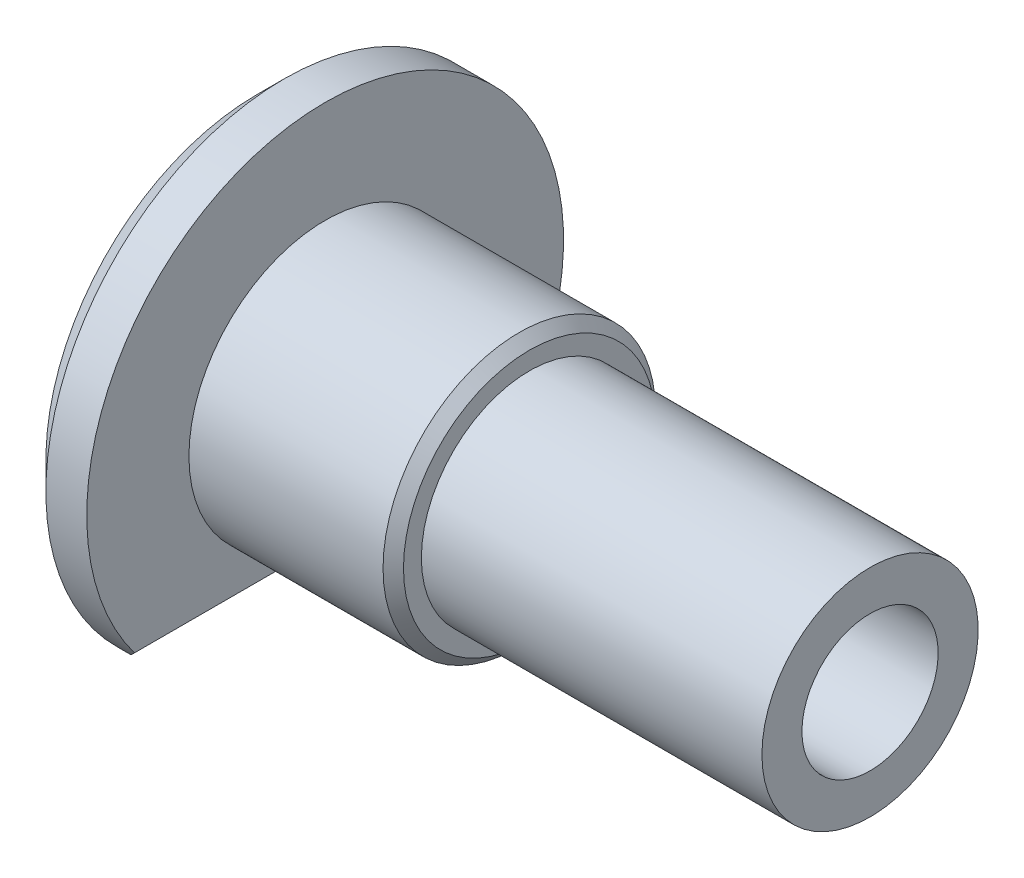
ISO-10303-21;
HEADER;
FILE_DESCRIPTION(('STEP AP214'),'2;1');
FILE_NAME('part.step','',(''),(''),'','','');
FILE_SCHEMA(('AUTOMOTIVE_DESIGN { 1 0 10303 214 1 1 1 1 }'));
ENDSEC;
DATA;
#1=APPLICATION_CONTEXT('core data for automotive mechanical design processes');
#2=APPLICATION_PROTOCOL_DEFINITION('international standard','automotive_design',2000,#1);
#3=PRODUCT_CONTEXT('',#1,'mechanical');
#4=PRODUCT('Part','Part','',(#3));
#5=PRODUCT_RELATED_PRODUCT_CATEGORY('part','',(#4));
#6=PRODUCT_DEFINITION_FORMATION('','',#4);
#7=PRODUCT_DEFINITION_CONTEXT('part definition',#1,'design');
#8=PRODUCT_DEFINITION('design','',#6,#7);
#9=PRODUCT_DEFINITION_SHAPE('','',#8);
#10=(LENGTH_UNIT() NAMED_UNIT(*) SI_UNIT(.MILLI.,.METRE.));
#11=(NAMED_UNIT(*) PLANE_ANGLE_UNIT() SI_UNIT($,.RADIAN.));
#12=(NAMED_UNIT(*) SI_UNIT($,.STERADIAN.) SOLID_ANGLE_UNIT());
#13=UNCERTAINTY_MEASURE_WITH_UNIT(LENGTH_MEASURE(1.E-05),#10,'distance_accuracy_value','');
#14=(GEOMETRIC_REPRESENTATION_CONTEXT(3) GLOBAL_UNCERTAINTY_ASSIGNED_CONTEXT((#13)) GLOBAL_UNIT_ASSIGNED_CONTEXT((#10,
#11,#12)) REPRESENTATION_CONTEXT('',''));
#15=CARTESIAN_POINT('',(0.,0.,0.));
#16=DIRECTION('',(0.,0.,1.));
#17=DIRECTION('',(1.,0.,0.));
#18=AXIS2_PLACEMENT_3D('',#15,#16,#17);
#19=CARTESIAN_POINT('',(2.,0.,-7.));
#20=DIRECTION('',(-1.,0.,0.));
#21=DIRECTION('',(0.,0.,1.));
#22=AXIS2_PLACEMENT_3D('',#19,#20,#21);
#23=PLANE('',#22);
#24=CARTESIAN_POINT('',(2.,0.,0.));
#25=DIRECTION('',(-1.,0.,0.));
#26=DIRECTION('',(0.,0.,1.));
#27=AXIS2_PLACEMENT_3D('',#24,#25,#26);
#28=CIRCLE('',#27,4.);
#29=CARTESIAN_POINT('',(2.,0.,4.));
#30=VERTEX_POINT('',#29);
#31=EDGE_CURVE('E107',#30,#30,#28,.T.);
#32=ORIENTED_EDGE('',*,*,#31,.T.);
#33=EDGE_LOOP('',(#32));
#34=FACE_BOUND('',#33,.T.);
#35=CARTESIAN_POINT('',(2.,0.,0.));
#36=DIRECTION('',(-1.,0.,0.));
#37=DIRECTION('',(0.,0.,1.));
#38=AXIS2_PLACEMENT_3D('',#35,#36,#37);
#39=CIRCLE('',#38,7.);
#40=CARTESIAN_POINT('',(2.,-4.2,5.6));
#41=VERTEX_POINT('',#40);
#42=CARTESIAN_POINT('',(2.,-4.2,-5.6));
#43=VERTEX_POINT('',#42);
#44=EDGE_CURVE('E105',#41,#43,#39,.T.);
#45=ORIENTED_EDGE('',*,*,#44,.F.);
#46=DIRECTION('',(0.,0.,-1.));
#47=VECTOR('',#46,1.);
#48=CARTESIAN_POINT('',(2.,-4.2,-4.89897948556636));
#49=LINE('',#48,#47);
#50=EDGE_CURVE('E11',#41,#43,#49,.T.);
#51=ORIENTED_EDGE('',*,*,#50,.T.);
#52=EDGE_LOOP('',(#45,#51));
#53=FACE_BOUND('',#52,.T.);
#54=ADVANCED_FACE('F33',(#34,#53),#23,.F.);
#55=CARTESIAN_POINT('',(0.,0.,0.));
#56=DIRECTION('',(-1.,0.,0.));
#57=DIRECTION('',(0.,0.,1.));
#58=AXIS2_PLACEMENT_3D('',#55,#56,#57);
#59=CYLINDRICAL_SURFACE('',#58,7.);
#60=DIRECTION('',(-1.,0.,0.));
#61=VECTOR('',#60,1.);
#62=CARTESIAN_POINT('',(18.,-5.,-4.89897948556636));
#63=LINE('',#62,#61);
#64=CARTESIAN_POINT('',(1.2,-5.,-4.89897948556636));
#65=VERTEX_POINT('',#64);
#66=CARTESIAN_POINT('',(0.800000000000006,-5.,-4.89897948556636));
#67=VERTEX_POINT('',#66);
#68=EDGE_CURVE('E93',#65,#67,#63,.T.);
#69=ORIENTED_EDGE('',*,*,#68,.T.);
#70=CARTESIAN_POINT('',(0.800000000000007,0.,0.));
#71=DIRECTION('',(1.,0.,0.));
#72=DIRECTION('',(0.,0.,-1.));
#73=AXIS2_PLACEMENT_3D('',#70,#71,#72);
#74=CIRCLE('',#73,7.);
#75=CARTESIAN_POINT('',(0.800000000000007,-5.,4.89897948556636));
#76=VERTEX_POINT('',#75);
#77=EDGE_CURVE('E41',#67,#76,#74,.T.);
#78=ORIENTED_EDGE('',*,*,#77,.T.);
#79=DIRECTION('',(-1.,0.,0.));
#80=VECTOR('',#79,1.);
#81=CARTESIAN_POINT('',(18.,-5.,4.89897948556636));
#82=LINE('',#81,#80);
#83=CARTESIAN_POINT('',(1.2,-5.,4.89897948556636));
#84=VERTEX_POINT('',#83);
#85=EDGE_CURVE('E95',#84,#76,#82,.T.);
#86=ORIENTED_EDGE('',*,*,#85,.F.);
#87=CARTESIAN_POINT('',(6.20000000000001,0.,0.));
#88=DIRECTION('',(0.707106781186547,-0.707106781186548,0.));
#89=DIRECTION('',(-0.707106781186548,-0.707106781186547,0.));
#90=AXIS2_PLACEMENT_3D('',#87,#88,#89);
#91=ELLIPSE('',#90,9.89949493661168,7.);
#92=EDGE_CURVE('E52',#84,#41,#91,.F.);
#93=ORIENTED_EDGE('',*,*,#92,.T.);
#94=ORIENTED_EDGE('',*,*,#44,.T.);
#95=CARTESIAN_POINT('',(6.20000000000001,0.,0.));
#96=DIRECTION('',(0.707106781186547,-0.707106781186548,0.));
#97=DIRECTION('',(-0.707106781186548,-0.707106781186547,0.));
#98=AXIS2_PLACEMENT_3D('',#95,#96,#97);
#99=ELLIPSE('',#98,9.89949493661168,7.);
#100=EDGE_CURVE('E81',#43,#65,#99,.F.);
#101=ORIENTED_EDGE('',*,*,#100,.T.);
#102=EDGE_LOOP('',(#69,#78,#86,#93,#94,#101));
#103=FACE_BOUND('',#102,.T.);
#104=ADVANCED_FACE('F160',(#103),#59,.T.);
#105=CARTESIAN_POINT('',(0.,0.,-7.));
#106=DIRECTION('',(1.,0.,0.));
#107=DIRECTION('',(0.,0.,-1.));
#108=AXIS2_PLACEMENT_3D('',#105,#106,#107);
#109=PLANE('',#108);
#110=CARTESIAN_POINT('',(0.,0.,0.));
#111=DIRECTION('',(-1.,0.,0.));
#112=DIRECTION('',(0.,0.,1.));
#113=AXIS2_PLACEMENT_3D('',#110,#111,#112);
#114=CIRCLE('',#113,2.);
#115=CARTESIAN_POINT('',(0.,0.,2.));
#116=VERTEX_POINT('',#115);
#117=EDGE_CURVE('E102',#116,#116,#114,.T.);
#118=ORIENTED_EDGE('',*,*,#117,.F.);
#119=EDGE_LOOP('',(#118));
#120=FACE_BOUND('',#119,.T.);
#121=DIRECTION('',(0.,0.,1.));
#122=VECTOR('',#121,1.);
#123=CARTESIAN_POINT('',(0.,-5.,0.));
#124=LINE('',#123,#122);
#125=CARTESIAN_POINT('',(0.,-5.,-3.66606055596466));
#126=VERTEX_POINT('',#125);
#127=CARTESIAN_POINT('',(0.,-5.,3.66606055596466));
#128=VERTEX_POINT('',#127);
#129=EDGE_CURVE('E87',#126,#128,#124,.T.);
#130=ORIENTED_EDGE('',*,*,#129,.T.);
#131=CARTESIAN_POINT('',(0.,0.,0.));
#132=DIRECTION('',(1.,0.,0.));
#133=DIRECTION('',(0.,0.,-1.));
#134=AXIS2_PLACEMENT_3D('',#131,#132,#133);
#135=CIRCLE('',#134,6.19999999999999);
#136=EDGE_CURVE('E76',#128,#126,#135,.F.);
#137=ORIENTED_EDGE('',*,*,#136,.T.);
#138=EDGE_LOOP('',(#130,#137));
#139=FACE_BOUND('',#138,.T.);
#140=ADVANCED_FACE('F86',(#120,#139),#109,.F.);
#141=CARTESIAN_POINT('',(18.,0.,-2.));
#142=DIRECTION('',(-1.,0.,0.));
#143=DIRECTION('',(0.,0.,1.));
#144=AXIS2_PLACEMENT_3D('',#141,#142,#143);
#145=PLANE('',#144);
#146=CARTESIAN_POINT('',(18.,0.,0.));
#147=DIRECTION('',(-1.,0.,0.));
#148=DIRECTION('',(0.,0.,1.));
#149=AXIS2_PLACEMENT_3D('',#146,#147,#148);
#150=CIRCLE('',#149,3.175);
#151=CARTESIAN_POINT('',(18.,0.,3.175));
#152=VERTEX_POINT('',#151);
#153=EDGE_CURVE('E89',#152,#152,#150,.T.);
#154=ORIENTED_EDGE('',*,*,#153,.F.);
#155=EDGE_LOOP('',(#154));
#156=FACE_BOUND('',#155,.T.);
#157=CARTESIAN_POINT('',(18.,0.,0.));
#158=DIRECTION('',(-1.,0.,0.));
#159=DIRECTION('',(0.,0.,1.));
#160=AXIS2_PLACEMENT_3D('',#157,#158,#159);
#161=CIRCLE('',#160,2.);
#162=CARTESIAN_POINT('',(18.,0.,2.));
#163=VERTEX_POINT('',#162);
#164=EDGE_CURVE('E98',#163,#163,#161,.T.);
#165=ORIENTED_EDGE('',*,*,#164,.T.);
#166=EDGE_LOOP('',(#165));
#167=FACE_BOUND('',#166,.T.);
#168=ADVANCED_FACE('F136',(#156,#167),#145,.F.);
#169=CARTESIAN_POINT('',(0.,0.,0.));
#170=DIRECTION('',(-1.,0.,0.));
#171=DIRECTION('',(0.,0.,1.));
#172=AXIS2_PLACEMENT_3D('',#169,#170,#171);
#173=CYLINDRICAL_SURFACE('',#172,3.175);
#174=CARTESIAN_POINT('',(8.,0.,0.));
#175=DIRECTION('',(-1.,0.,0.));
#176=DIRECTION('',(0.,0.,1.));
#177=AXIS2_PLACEMENT_3D('',#174,#175,#176);
#178=CIRCLE('',#177,3.175);
#179=CARTESIAN_POINT('',(8.,0.,3.175));
#180=VERTEX_POINT('',#179);
#181=EDGE_CURVE('E116',#180,#180,#178,.T.);
#182=ORIENTED_EDGE('',*,*,#181,.F.);
#183=EDGE_LOOP('',(#182));
#184=FACE_BOUND('',#183,.T.);
#185=ORIENTED_EDGE('',*,*,#153,.T.);
#186=EDGE_LOOP('',(#185));
#187=FACE_BOUND('',#186,.T.);
#188=ADVANCED_FACE('F140',(#184,#187),#173,.T.);
#189=CARTESIAN_POINT('',(8.,0.,-3.7));
#190=DIRECTION('',(-1.,0.,0.));
#191=DIRECTION('',(0.,0.,1.));
#192=AXIS2_PLACEMENT_3D('',#189,#190,#191);
#193=PLANE('',#192);
#194=CARTESIAN_POINT('',(8.,0.,0.));
#195=DIRECTION('',(-1.,0.,0.));
#196=DIRECTION('',(0.,0.,1.));
#197=AXIS2_PLACEMENT_3D('',#194,#195,#196);
#198=CIRCLE('',#197,3.7);
#199=CARTESIAN_POINT('',(8.,0.,3.7));
#200=VERTEX_POINT('',#199);
#201=EDGE_CURVE('E113',#200,#200,#198,.T.);
#202=ORIENTED_EDGE('',*,*,#201,.F.);
#203=EDGE_LOOP('',(#202));
#204=FACE_BOUND('',#203,.T.);
#205=ORIENTED_EDGE('',*,*,#181,.T.);
#206=EDGE_LOOP('',(#205));
#207=FACE_BOUND('',#206,.T.);
#208=ADVANCED_FACE('F144',(#204,#207),#193,.F.);
#209=CARTESIAN_POINT('',(8.,0.,0.));
#210=DIRECTION('',(-1.,0.,0.));
#211=DIRECTION('',(0.,0.,1.));
#212=AXIS2_PLACEMENT_3D('',#209,#210,#211);
#213=CONICAL_SURFACE('',#212,3.7,0.785398163397448);
#214=CARTESIAN_POINT('',(7.7,0.,0.));
#215=DIRECTION('',(-1.,0.,0.));
#216=DIRECTION('',(0.,0.,1.));
#217=AXIS2_PLACEMENT_3D('',#214,#215,#216);
#218=CIRCLE('',#217,4.);
#219=CARTESIAN_POINT('',(7.7,0.,4.));
#220=VERTEX_POINT('',#219);
#221=EDGE_CURVE('E110',#220,#220,#218,.T.);
#222=ORIENTED_EDGE('',*,*,#221,.F.);
#223=EDGE_LOOP('',(#222));
#224=FACE_BOUND('',#223,.T.);
#225=ORIENTED_EDGE('',*,*,#201,.T.);
#226=EDGE_LOOP('',(#225));
#227=FACE_BOUND('',#226,.T.);
#228=ADVANCED_FACE('F148',(#224,#227),#213,.T.);
#229=CARTESIAN_POINT('',(0.,0.,0.));
#230=DIRECTION('',(-1.,0.,0.));
#231=DIRECTION('',(0.,0.,1.));
#232=AXIS2_PLACEMENT_3D('',#229,#230,#231);
#233=CYLINDRICAL_SURFACE('',#232,4.);
#234=ORIENTED_EDGE('',*,*,#31,.F.);
#235=EDGE_LOOP('',(#234));
#236=FACE_BOUND('',#235,.T.);
#237=ORIENTED_EDGE('',*,*,#221,.T.);
#238=EDGE_LOOP('',(#237));
#239=FACE_BOUND('',#238,.T.);
#240=ADVANCED_FACE('F152',(#236,#239),#233,.T.);
#241=CARTESIAN_POINT('',(0.,0.,0.));
#242=DIRECTION('',(-1.,0.,0.));
#243=DIRECTION('',(0.,0.,1.));
#244=AXIS2_PLACEMENT_3D('',#241,#242,#243);
#245=CYLINDRICAL_SURFACE('',#244,2.);
#246=ORIENTED_EDGE('',*,*,#164,.F.);
#247=EDGE_LOOP('',(#246));
#248=FACE_BOUND('',#247,.T.);
#249=ORIENTED_EDGE('',*,*,#117,.T.);
#250=EDGE_LOOP('',(#249));
#251=FACE_BOUND('',#250,.T.);
#252=ADVANCED_FACE('F156',(#248,#251),#245,.F.);
#253=CARTESIAN_POINT('',(18.,-5.,0.));
#254=DIRECTION('',(0.,-1.,0.));
#255=DIRECTION('',(0.,0.,-1.));
#256=AXIS2_PLACEMENT_3D('',#253,#254,#255);
#257=PLANE('',#256);
#258=ORIENTED_EDGE('',*,*,#129,.F.);
#259=CARTESIAN_POINT('',(0.,-5.,-3.66606055596466));
#260=CARTESIAN_POINT('',(0.0623770414740901,-5.,-3.77153418632983));
#261=CARTESIAN_POINT('',(0.126031359884147,-5.,-3.87624321891758));
#262=CARTESIAN_POINT('',(0.255560542208627,-5.,-4.08422734054839));
#263=CARTESIAN_POINT('',(0.321434591116565,-5.,-4.18750293665151));
#264=CARTESIAN_POINT('',(0.455110503166271,-5.,-4.39278497356235));
#265=CARTESIAN_POINT('',(0.522912236486564,-5.,-4.49479149917466));
#266=CARTESIAN_POINT('',(0.660233218693217,-5.,-4.69769676238497));
#267=CARTESIAN_POINT('',(0.729753082188201,-5.,-4.79859508435465));
#268=CARTESIAN_POINT('',(0.800000000000006,-5.,-4.89897948556636));
#269=B_SPLINE_CURVE_WITH_KNOTS('',3,(#259,#260,#261,#262,#263,#264,#265,#266,#267,#268),
.UNSPECIFIED.,.F.,.F.,(4,2,2,2,4),(0.,0.367593813797581,0.735054100097912,1.10248969783322,
1.4700586933324),.UNSPECIFIED.);
#270=EDGE_CURVE('E72',#126,#67,#269,.T.);
#271=ORIENTED_EDGE('',*,*,#270,.T.);
#272=ORIENTED_EDGE('',*,*,#68,.F.);
#273=DIRECTION('',(0.,0.,1.));
#274=VECTOR('',#273,1.);
#275=CARTESIAN_POINT('',(1.2,-5.,4.89897948556636));
#276=LINE('',#275,#274);
#277=EDGE_CURVE('E88',#65,#84,#276,.T.);
#278=ORIENTED_EDGE('',*,*,#277,.T.);
#279=ORIENTED_EDGE('',*,*,#85,.T.);
#280=CARTESIAN_POINT('',(0.800000000000007,-5.,4.89897948556636));
#281=CARTESIAN_POINT('',(0.729753082188202,-5.,4.79859508435466));
#282=CARTESIAN_POINT('',(0.660233218693218,-5.,4.69769676238497));
#283=CARTESIAN_POINT('',(0.522912236486565,-5.,4.49479149917466));
#284=CARTESIAN_POINT('',(0.455110503166271,-5.,4.39278497356235));
#285=CARTESIAN_POINT('',(0.321434591116565,-5.,4.18750293665151));
#286=CARTESIAN_POINT('',(0.255560542208627,-5.,4.08422734054839));
#287=CARTESIAN_POINT('',(0.126031359884146,-5.,3.87624321891758));
#288=CARTESIAN_POINT('',(0.06237704147409,-5.,3.77153418632983));
#289=CARTESIAN_POINT('',(0.,-5.,3.66606055596466));
#290=B_SPLINE_CURVE_WITH_KNOTS('',3,(#280,#281,#282,#283,#284,#285,#286,#287,#288,#289),
.UNSPECIFIED.,.F.,.F.,(4,2,2,2,4),(0.,0.367568995499183,0.735004593234491,1.10246487953482,
1.4700586933324),.UNSPECIFIED.);
#291=EDGE_CURVE('E82',#76,#128,#290,.T.);
#292=ORIENTED_EDGE('',*,*,#291,.T.);
#293=EDGE_LOOP('',(#258,#271,#272,#278,#279,#292));
#294=FACE_BOUND('',#293,.T.);
#295=ADVANCED_FACE('F91',(#294),#257,.T.);
#296=CARTESIAN_POINT('',(0.,0.,0.));
#297=DIRECTION('',(1.,0.,0.));
#298=DIRECTION('',(0.,0.,-1.));
#299=AXIS2_PLACEMENT_3D('',#296,#297,#298);
#300=CONICAL_SURFACE('',#299,6.19999999999999,0.785398163397448);
#301=ORIENTED_EDGE('',*,*,#291,.F.);
#302=ORIENTED_EDGE('',*,*,#77,.F.);
#303=ORIENTED_EDGE('',*,*,#270,.F.);
#304=ORIENTED_EDGE('',*,*,#136,.F.);
#305=EDGE_LOOP('',(#301,#302,#303,#304));
#306=FACE_BOUND('',#305,.T.);
#307=ADVANCED_FACE('F75',(#306),#300,.T.);
#308=CARTESIAN_POINT('',(1.2,-5.,0.));
#309=DIRECTION('',(0.707106781186547,-0.707106781186548,0.));
#310=DIRECTION('',(0.707106781186548,0.707106781186547,0.));
#311=AXIS2_PLACEMENT_3D('',#308,#309,#310);
#312=PLANE('',#311);
#313=ORIENTED_EDGE('',*,*,#100,.F.);
#314=ORIENTED_EDGE('',*,*,#50,.F.);
#315=ORIENTED_EDGE('',*,*,#92,.F.);
#316=ORIENTED_EDGE('',*,*,#277,.F.);
#317=EDGE_LOOP('',(#313,#314,#315,#316));
#318=FACE_BOUND('',#317,.T.);
#319=ADVANCED_FACE('F35',(#318),#312,.T.);
#320=CLOSED_SHELL('',(#54,#104,#140,#168,#188,#208,#228,#240,#252,#295,#307,#319));
#321=MANIFOLD_SOLID_BREP('B2',#320);
#322=ADVANCED_BREP_SHAPE_REPRESENTATION('',(#18,#321),#14);
#323=SHAPE_DEFINITION_REPRESENTATION(#9,#322);
ENDSEC;
END-ISO-10303-21;
